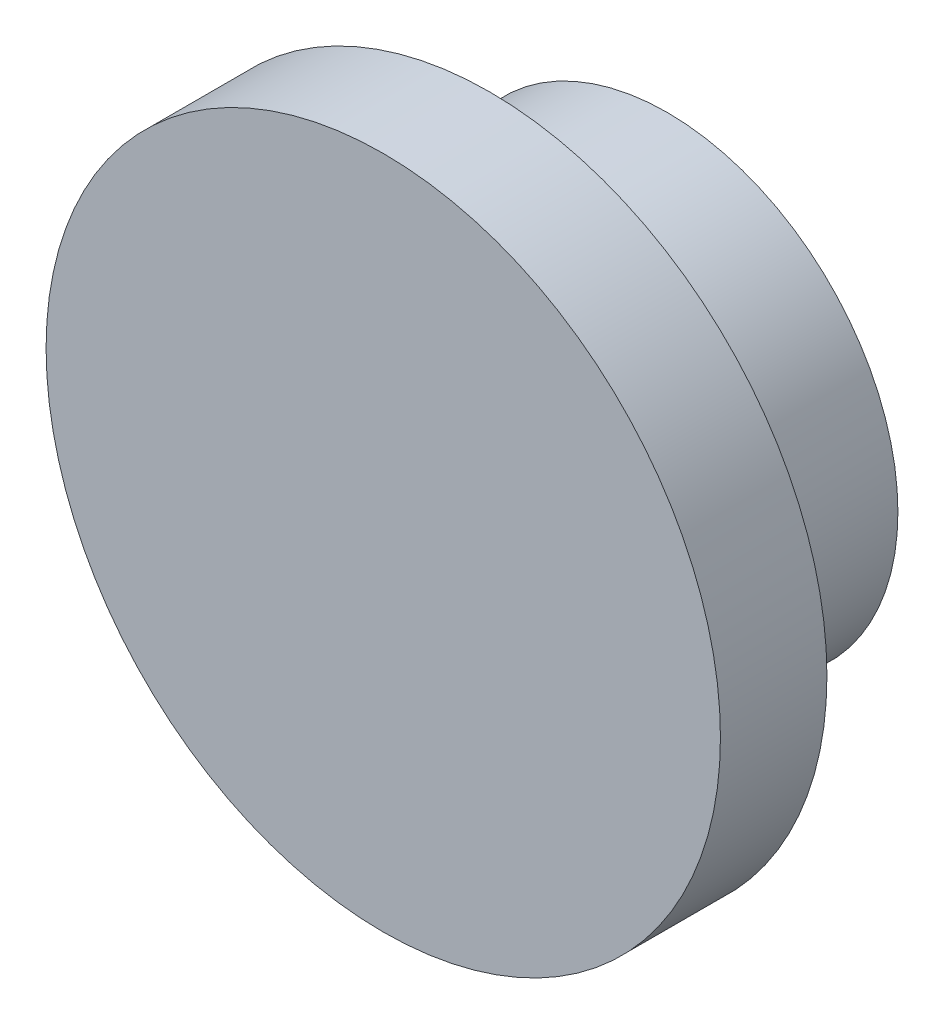
ISO-10303-21;
HEADER;
FILE_DESCRIPTION(('STEP AP214'),'2;1');
FILE_NAME('part.step','',(''),(''),'','','');
FILE_SCHEMA(('AUTOMOTIVE_DESIGN { 1 0 10303 214 1 1 1 1 }'));
ENDSEC;
DATA;
#1=APPLICATION_CONTEXT('core data for automotive mechanical design processes');
#2=APPLICATION_PROTOCOL_DEFINITION('international standard','automotive_design',2000,#1);
#3=PRODUCT_CONTEXT('',#1,'mechanical');
#4=PRODUCT('Part','Part','',(#3));
#5=PRODUCT_RELATED_PRODUCT_CATEGORY('part','',(#4));
#6=PRODUCT_DEFINITION_FORMATION('','',#4);
#7=PRODUCT_DEFINITION_CONTEXT('part definition',#1,'design');
#8=PRODUCT_DEFINITION('design','',#6,#7);
#9=PRODUCT_DEFINITION_SHAPE('','',#8);
#10=(LENGTH_UNIT() NAMED_UNIT(*) SI_UNIT(.MILLI.,.METRE.));
#11=(NAMED_UNIT(*) PLANE_ANGLE_UNIT() SI_UNIT($,.RADIAN.));
#12=(NAMED_UNIT(*) SI_UNIT($,.STERADIAN.) SOLID_ANGLE_UNIT());
#13=UNCERTAINTY_MEASURE_WITH_UNIT(LENGTH_MEASURE(1.E-05),#10,'distance_accuracy_value','');
#14=(GEOMETRIC_REPRESENTATION_CONTEXT(3) GLOBAL_UNCERTAINTY_ASSIGNED_CONTEXT((#13)) GLOBAL_UNIT_ASSIGNED_CONTEXT((#10,
#11,#12)) REPRESENTATION_CONTEXT('',''));
#15=CARTESIAN_POINT('',(0.,0.,0.));
#16=DIRECTION('',(0.,0.,1.));
#17=DIRECTION('',(1.,0.,0.));
#18=AXIS2_PLACEMENT_3D('',#15,#16,#17);
#19=CARTESIAN_POINT('',(0.,0.,0.));
#20=DIRECTION('',(0.,0.,1.));
#21=DIRECTION('',(0.,-1.,0.));
#22=AXIS2_PLACEMENT_3D('',#19,#20,#21);
#23=PLANE('',#22);
#24=CARTESIAN_POINT('',(0.,0.,0.));
#25=DIRECTION('',(0.,0.,-1.));
#26=DIRECTION('',(0.,1.,0.));
#27=AXIS2_PLACEMENT_3D('',#24,#25,#26);
#28=CIRCLE('',#27,2.413);
#29=CARTESIAN_POINT('',(0.,2.413,0.));
#30=VERTEX_POINT('',#29);
#31=EDGE_CURVE('E10',#30,#30,#28,.T.);
#32=ORIENTED_EDGE('',*,*,#31,.F.);
#33=EDGE_LOOP('',(#32));
#34=FACE_BOUND('',#33,.T.);
#35=ADVANCED_FACE('F35',(#34),#23,.T.);
#36=CARTESIAN_POINT('',(0.,0.,-2.032));
#37=DIRECTION('',(0.,0.,-1.));
#38=DIRECTION('',(0.,1.,0.));
#39=AXIS2_PLACEMENT_3D('',#36,#37,#38);
#40=CYLINDRICAL_SURFACE('',#39,2.413);
#41=ORIENTED_EDGE('',*,*,#31,.T.);
#42=EDGE_LOOP('',(#41));
#43=FACE_BOUND('',#42,.T.);
#44=CARTESIAN_POINT('',(0.,0.,-0.762));
#45=DIRECTION('',(0.,0.,-1.));
#46=DIRECTION('',(0.,1.,0.));
#47=AXIS2_PLACEMENT_3D('',#44,#45,#46);
#48=CIRCLE('',#47,2.413);
#49=CARTESIAN_POINT('',(0.,2.413,-0.762));
#50=VERTEX_POINT('',#49);
#51=EDGE_CURVE('E41',#50,#50,#48,.T.);
#52=ORIENTED_EDGE('',*,*,#51,.F.);
#53=EDGE_LOOP('',(#52));
#54=FACE_BOUND('',#53,.T.);
#55=ADVANCED_FACE('F67',(#43,#54),#40,.T.);
#56=CARTESIAN_POINT('',(0.,2.413,-0.762));
#57=DIRECTION('',(0.,0.,-1.));
#58=DIRECTION('',(0.,1.,0.));
#59=AXIS2_PLACEMENT_3D('',#56,#57,#58);
#60=PLANE('',#59);
#61=ORIENTED_EDGE('',*,*,#51,.T.);
#62=EDGE_LOOP('',(#61));
#63=FACE_BOUND('',#62,.T.);
#64=CARTESIAN_POINT('',(0.,0.,-0.762));
#65=DIRECTION('',(0.,0.,-1.));
#66=DIRECTION('',(0.,1.,0.));
#67=AXIS2_PLACEMENT_3D('',#64,#65,#66);
#68=CIRCLE('',#67,1.651);
#69=CARTESIAN_POINT('',(0.,1.651,-0.762));
#70=VERTEX_POINT('',#69);
#71=EDGE_CURVE('E45',#70,#70,#68,.T.);
#72=ORIENTED_EDGE('',*,*,#71,.F.);
#73=EDGE_LOOP('',(#72));
#74=FACE_BOUND('',#73,.T.);
#75=ADVANCED_FACE('F59',(#63,#74),#60,.T.);
#76=CARTESIAN_POINT('',(0.,0.,-2.032));
#77=DIRECTION('',(0.,0.,-1.));
#78=DIRECTION('',(0.,1.,0.));
#79=AXIS2_PLACEMENT_3D('',#76,#77,#78);
#80=CYLINDRICAL_SURFACE('',#79,1.651);
#81=ORIENTED_EDGE('',*,*,#71,.T.);
#82=EDGE_LOOP('',(#81));
#83=FACE_BOUND('',#82,.T.);
#84=CARTESIAN_POINT('',(0.,0.,-2.032));
#85=DIRECTION('',(0.,0.,-1.));
#86=DIRECTION('',(0.,1.,0.));
#87=AXIS2_PLACEMENT_3D('',#84,#85,#86);
#88=CIRCLE('',#87,1.651);
#89=CARTESIAN_POINT('',(0.,1.651,-2.032));
#90=VERTEX_POINT('',#89);
#91=EDGE_CURVE('E49',#90,#90,#88,.T.);
#92=ORIENTED_EDGE('',*,*,#91,.F.);
#93=EDGE_LOOP('',(#92));
#94=FACE_BOUND('',#93,.T.);
#95=ADVANCED_FACE('F57',(#83,#94),#80,.T.);
#96=CARTESIAN_POINT('',(0.,1.651,-2.032));
#97=DIRECTION('',(0.,0.,-1.));
#98=DIRECTION('',(0.,1.,0.));
#99=AXIS2_PLACEMENT_3D('',#96,#97,#98);
#100=PLANE('',#99);
#101=ORIENTED_EDGE('',*,*,#91,.T.);
#102=EDGE_LOOP('',(#101));
#103=FACE_BOUND('',#102,.T.);
#104=ADVANCED_FACE('F55',(#103),#100,.T.);
#105=CLOSED_SHELL('',(#35,#55,#75,#95,#104));
#106=MANIFOLD_SOLID_BREP('B2',#105);
#107=ADVANCED_BREP_SHAPE_REPRESENTATION('',(#18,#106),#14);
#108=SHAPE_DEFINITION_REPRESENTATION(#9,#107);
ENDSEC;
END-ISO-10303-21;
